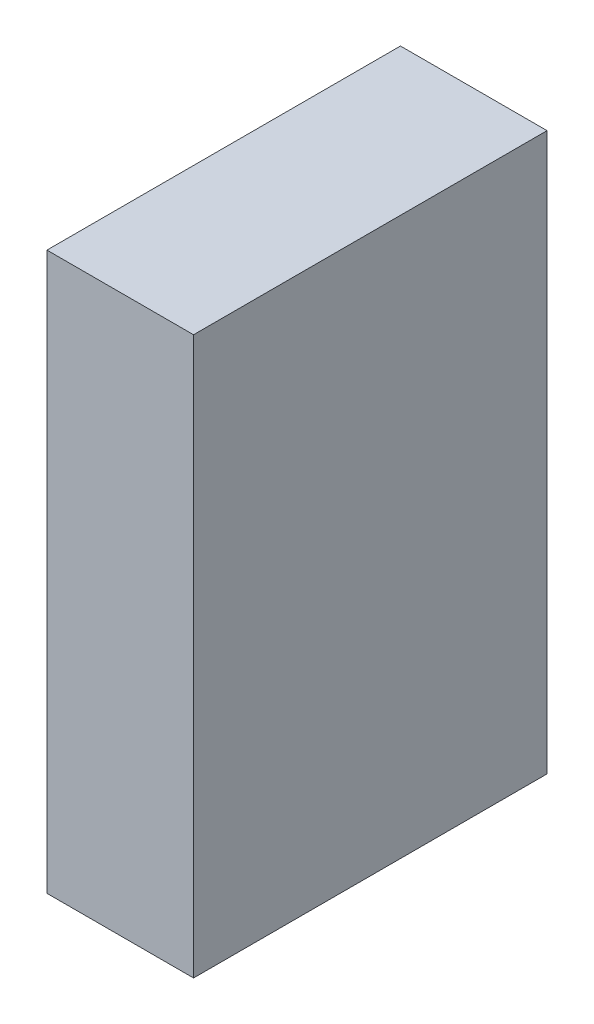
ISO-10303-21;
HEADER;
FILE_DESCRIPTION(('STEP AP214'),'2;1');
FILE_NAME('part.step','',(''),(''),'','','');
FILE_SCHEMA(('AUTOMOTIVE_DESIGN { 1 0 10303 214 1 1 1 1 }'));
ENDSEC;
DATA;
#1=APPLICATION_CONTEXT('core data for automotive mechanical design processes');
#2=APPLICATION_PROTOCOL_DEFINITION('international standard','automotive_design',2000,#1);
#3=PRODUCT_CONTEXT('',#1,'mechanical');
#4=PRODUCT('Part','Part','',(#3));
#5=PRODUCT_RELATED_PRODUCT_CATEGORY('part','',(#4));
#6=PRODUCT_DEFINITION_FORMATION('','',#4);
#7=PRODUCT_DEFINITION_CONTEXT('part definition',#1,'design');
#8=PRODUCT_DEFINITION('design','',#6,#7);
#9=PRODUCT_DEFINITION_SHAPE('','',#8);
#10=(LENGTH_UNIT() NAMED_UNIT(*) SI_UNIT(.MILLI.,.METRE.));
#11=(NAMED_UNIT(*) PLANE_ANGLE_UNIT() SI_UNIT($,.RADIAN.));
#12=(NAMED_UNIT(*) SI_UNIT($,.STERADIAN.) SOLID_ANGLE_UNIT());
#13=UNCERTAINTY_MEASURE_WITH_UNIT(LENGTH_MEASURE(1.E-05),#10,'distance_accuracy_value','');
#14=(GEOMETRIC_REPRESENTATION_CONTEXT(3) GLOBAL_UNCERTAINTY_ASSIGNED_CONTEXT((#13)) GLOBAL_UNIT_ASSIGNED_CONTEXT((#10,
#11,#12)) REPRESENTATION_CONTEXT('',''));
#15=CARTESIAN_POINT('',(0.,0.,0.));
#16=DIRECTION('',(0.,0.,1.));
#17=DIRECTION('',(1.,0.,0.));
#18=AXIS2_PLACEMENT_3D('',#15,#16,#17);
#19=CARTESIAN_POINT('',(-0.37500052,-1.42500096,0.));
#20=DIRECTION('',(-1.,0.,0.));
#21=DIRECTION('',(0.,0.,1.));
#22=AXIS2_PLACEMENT_3D('',#19,#20,#21);
#23=PLANE('',#22);
#24=DIRECTION('',(0.,0.,1.));
#25=VECTOR('',#24,1.);
#26=CARTESIAN_POINT('',(-0.37500052,1.42500096,0.));
#27=LINE('',#26,#25);
#28=CARTESIAN_POINT('',(-0.37500052,1.42500096,0.));
#29=VERTEX_POINT('',#28);
#30=CARTESIAN_POINT('',(-0.37500052,1.42500096,1.80848));
#31=VERTEX_POINT('',#30);
#32=EDGE_CURVE('E20',#29,#31,#27,.T.);
#33=ORIENTED_EDGE('',*,*,#32,.F.);
#34=DIRECTION('',(0.,1.,0.));
#35=VECTOR('',#34,1.);
#36=CARTESIAN_POINT('',(-0.37500052,1.42500096,0.));
#37=LINE('',#36,#35);
#38=CARTESIAN_POINT('',(-0.37500052,-1.42500096,0.));
#39=VERTEX_POINT('',#38);
#40=EDGE_CURVE('E80',#29,#39,#37,.F.);
#41=ORIENTED_EDGE('',*,*,#40,.T.);
#42=DIRECTION('',(0.,0.,-1.));
#43=VECTOR('',#42,1.);
#44=CARTESIAN_POINT('',(-0.37500052,-1.42500096,0.));
#45=LINE('',#44,#43);
#46=CARTESIAN_POINT('',(-0.37500052,-1.42500096,1.80848));
#47=VERTEX_POINT('',#46);
#48=EDGE_CURVE('E68',#47,#39,#45,.T.);
#49=ORIENTED_EDGE('',*,*,#48,.F.);
#50=DIRECTION('',(0.,1.,0.));
#51=VECTOR('',#50,1.);
#52=CARTESIAN_POINT('',(-0.37500052,1.42500096,1.80848));
#53=LINE('',#52,#51);
#54=EDGE_CURVE('E56',#31,#47,#53,.F.);
#55=ORIENTED_EDGE('',*,*,#54,.F.);
#56=EDGE_LOOP('',(#33,#41,#49,#55));
#57=FACE_BOUND('',#56,.T.);
#58=ADVANCED_FACE('F17',(#57),#23,.T.);
#59=CARTESIAN_POINT('',(-0.37500052,1.42500096,0.));
#60=DIRECTION('',(0.,1.,0.));
#61=DIRECTION('',(0.,0.,1.));
#62=AXIS2_PLACEMENT_3D('',#59,#60,#61);
#63=PLANE('',#62);
#64=DIRECTION('',(0.,0.,-1.));
#65=VECTOR('',#64,1.);
#66=CARTESIAN_POINT('',(0.37500052,1.42500096,0.));
#67=LINE('',#66,#65);
#68=CARTESIAN_POINT('',(0.37500052,1.42500096,0.));
#69=VERTEX_POINT('',#68);
#70=CARTESIAN_POINT('',(0.37500052,1.42500096,1.80848));
#71=VERTEX_POINT('',#70);
#72=EDGE_CURVE('E83',#69,#71,#67,.F.);
#73=ORIENTED_EDGE('',*,*,#72,.F.);
#74=DIRECTION('',(1.,0.,0.));
#75=VECTOR('',#74,1.);
#76=CARTESIAN_POINT('',(0.37500052,1.42500096,0.));
#77=LINE('',#76,#75);
#78=EDGE_CURVE('E65',#69,#29,#77,.F.);
#79=ORIENTED_EDGE('',*,*,#78,.T.);
#80=ORIENTED_EDGE('',*,*,#32,.T.);
#81=DIRECTION('',(1.,0.,0.));
#82=VECTOR('',#81,1.);
#83=CARTESIAN_POINT('',(0.37500052,1.42500096,1.80848));
#84=LINE('',#83,#82);
#85=EDGE_CURVE('E62',#71,#31,#84,.F.);
#86=ORIENTED_EDGE('',*,*,#85,.F.);
#87=EDGE_LOOP('',(#73,#79,#80,#86));
#88=FACE_BOUND('',#87,.T.);
#89=ADVANCED_FACE('F61',(#88),#63,.T.);
#90=CARTESIAN_POINT('',(0.37500052,1.42500096,1.80848));
#91=DIRECTION('',(0.,0.,1.));
#92=DIRECTION('',(1.,0.,0.));
#93=AXIS2_PLACEMENT_3D('',#90,#91,#92);
#94=PLANE('',#93);
#95=DIRECTION('',(1.,0.,0.));
#96=VECTOR('',#95,1.);
#97=CARTESIAN_POINT('',(0.37500052,-1.42500096,1.80848));
#98=LINE('',#97,#96);
#99=CARTESIAN_POINT('',(0.37500052,-1.42500096,1.80848));
#100=VERTEX_POINT('',#99);
#101=EDGE_CURVE('E70',#100,#47,#98,.F.);
#102=ORIENTED_EDGE('',*,*,#101,.F.);
#103=DIRECTION('',(0.,1.,0.));
#104=VECTOR('',#103,1.);
#105=CARTESIAN_POINT('',(0.37500052,1.42500096,1.80848));
#106=LINE('',#105,#104);
#107=EDGE_CURVE('E74',#71,#100,#106,.F.);
#108=ORIENTED_EDGE('',*,*,#107,.F.);
#109=ORIENTED_EDGE('',*,*,#85,.T.);
#110=ORIENTED_EDGE('',*,*,#54,.T.);
#111=EDGE_LOOP('',(#102,#108,#109,#110));
#112=FACE_BOUND('',#111,.T.);
#113=ADVANCED_FACE('F72',(#112),#94,.T.);
#114=CARTESIAN_POINT('',(0.37500052,-1.42500096,0.));
#115=DIRECTION('',(0.,-1.,0.));
#116=DIRECTION('',(0.,0.,-1.));
#117=AXIS2_PLACEMENT_3D('',#114,#115,#116);
#118=PLANE('',#117);
#119=ORIENTED_EDGE('',*,*,#48,.T.);
#120=DIRECTION('',(1.,0.,0.));
#121=VECTOR('',#120,1.);
#122=CARTESIAN_POINT('',(0.37500052,-1.42500096,0.));
#123=LINE('',#122,#121);
#124=CARTESIAN_POINT('',(0.37500052,-1.42500096,0.));
#125=VERTEX_POINT('',#124);
#126=EDGE_CURVE('E35',#39,#125,#123,.T.);
#127=ORIENTED_EDGE('',*,*,#126,.T.);
#128=DIRECTION('',(0.,0.,-1.));
#129=VECTOR('',#128,1.);
#130=CARTESIAN_POINT('',(0.37500052,-1.42500096,0.));
#131=LINE('',#130,#129);
#132=EDGE_CURVE('E26',#100,#125,#131,.T.);
#133=ORIENTED_EDGE('',*,*,#132,.F.);
#134=ORIENTED_EDGE('',*,*,#101,.T.);
#135=EDGE_LOOP('',(#119,#127,#133,#134));
#136=FACE_BOUND('',#135,.T.);
#137=ADVANCED_FACE('F89',(#136),#118,.T.);
#138=CARTESIAN_POINT('',(0.37500052,1.42500096,0.));
#139=DIRECTION('',(0.,0.,1.));
#140=DIRECTION('',(1.,0.,0.));
#141=AXIS2_PLACEMENT_3D('',#138,#139,#140);
#142=PLANE('',#141);
#143=ORIENTED_EDGE('',*,*,#126,.F.);
#144=ORIENTED_EDGE('',*,*,#40,.F.);
#145=ORIENTED_EDGE('',*,*,#78,.F.);
#146=DIRECTION('',(0.,1.,0.));
#147=VECTOR('',#146,1.);
#148=CARTESIAN_POINT('',(0.37500052,1.42500096,0.));
#149=LINE('',#148,#147);
#150=EDGE_CURVE('E11',#125,#69,#149,.T.);
#151=ORIENTED_EDGE('',*,*,#150,.F.);
#152=EDGE_LOOP('',(#143,#144,#145,#151));
#153=FACE_BOUND('',#152,.T.);
#154=ADVANCED_FACE('F91',(#153),#142,.F.);
#155=CARTESIAN_POINT('',(0.37500052,1.42500096,0.));
#156=DIRECTION('',(1.,0.,0.));
#157=DIRECTION('',(0.,0.,-1.));
#158=AXIS2_PLACEMENT_3D('',#155,#156,#157);
#159=PLANE('',#158);
#160=ORIENTED_EDGE('',*,*,#132,.T.);
#161=ORIENTED_EDGE('',*,*,#150,.T.);
#162=ORIENTED_EDGE('',*,*,#72,.T.);
#163=ORIENTED_EDGE('',*,*,#107,.T.);
#164=EDGE_LOOP('',(#160,#161,#162,#163));
#165=FACE_BOUND('',#164,.T.);
#166=ADVANCED_FACE('F88',(#165),#159,.T.);
#167=CLOSED_SHELL('',(#58,#89,#113,#137,#154,#166));
#168=MANIFOLD_SOLID_BREP('B1',#167);
#169=ADVANCED_BREP_SHAPE_REPRESENTATION('',(#18,#168),#14);
#170=SHAPE_DEFINITION_REPRESENTATION(#9,#169);
ENDSEC;
END-ISO-10303-21;
